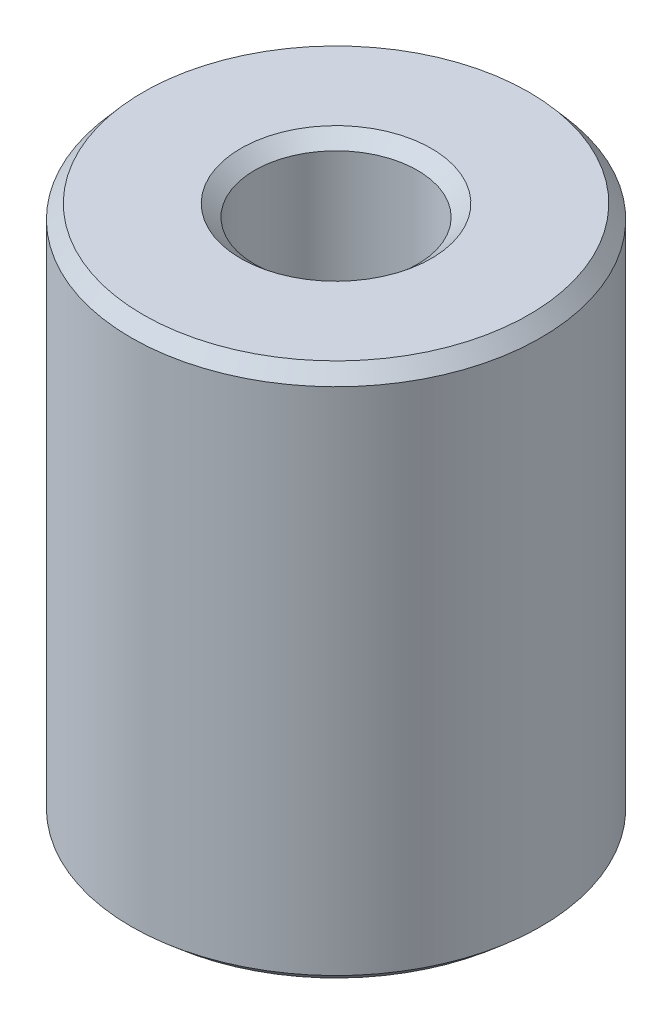
ISO-10303-21;
HEADER;
FILE_DESCRIPTION(('STEP AP214'),'2;1');
FILE_NAME('part.step','',(''),(''),'','','');
FILE_SCHEMA(('AUTOMOTIVE_DESIGN { 1 0 10303 214 1 1 1 1 }'));
ENDSEC;
DATA;
#1=APPLICATION_CONTEXT('core data for automotive mechanical design processes');
#2=APPLICATION_PROTOCOL_DEFINITION('international standard','automotive_design',2000,#1);
#3=PRODUCT_CONTEXT('',#1,'mechanical');
#4=PRODUCT('Part','Part','',(#3));
#5=PRODUCT_RELATED_PRODUCT_CATEGORY('part','',(#4));
#6=PRODUCT_DEFINITION_FORMATION('','',#4);
#7=PRODUCT_DEFINITION_CONTEXT('part definition',#1,'design');
#8=PRODUCT_DEFINITION('design','',#6,#7);
#9=PRODUCT_DEFINITION_SHAPE('','',#8);
#10=(LENGTH_UNIT() NAMED_UNIT(*) SI_UNIT(.MILLI.,.METRE.));
#11=(NAMED_UNIT(*) PLANE_ANGLE_UNIT() SI_UNIT($,.RADIAN.));
#12=(NAMED_UNIT(*) SI_UNIT($,.STERADIAN.) SOLID_ANGLE_UNIT());
#13=UNCERTAINTY_MEASURE_WITH_UNIT(LENGTH_MEASURE(1.E-05),#10,'distance_accuracy_value','');
#14=(GEOMETRIC_REPRESENTATION_CONTEXT(3) GLOBAL_UNCERTAINTY_ASSIGNED_CONTEXT((#13)) GLOBAL_UNIT_ASSIGNED_CONTEXT((#10,
#11,#12)) REPRESENTATION_CONTEXT('',''));
#15=CARTESIAN_POINT('',(0.,0.,0.));
#16=DIRECTION('',(0.,0.,1.));
#17=DIRECTION('',(1.,0.,0.));
#18=AXIS2_PLACEMENT_3D('',#15,#16,#17);
#19=CARTESIAN_POINT('',(0.,71.9350325143763,0.));
#20=DIRECTION('',(0.,-1.,0.));
#21=DIRECTION('',(0.,0.,-1.));
#22=AXIS2_PLACEMENT_3D('',#19,#20,#21);
#23=CYLINDRICAL_SURFACE('',#22,27.5);
#24=CARTESIAN_POINT('',(0.,1.60686689080611,0.));
#25=DIRECTION('',(0.,1.,0.));
#26=DIRECTION('',(0.,0.,1.));
#27=AXIS2_PLACEMENT_3D('',#24,#25,#26);
#28=CIRCLE('',#27,27.5);
#29=CARTESIAN_POINT('',(0.,1.60686689080611,27.5));
#30=VERTEX_POINT('',#29);
#31=EDGE_CURVE('E10',#30,#30,#28,.T.);
#32=ORIENTED_EDGE('',*,*,#31,.T.);
#33=EDGE_LOOP('',(#32));
#34=FACE_BOUND('',#33,.T.);
#35=CARTESIAN_POINT('',(0.,70.065515395934,0.));
#36=DIRECTION('',(0.,1.,0.));
#37=DIRECTION('',(0.,0.,1.));
#38=AXIS2_PLACEMENT_3D('',#35,#36,#37);
#39=CIRCLE('',#38,27.5);
#40=CARTESIAN_POINT('',(0.,70.065515395934,27.5));
#41=VERTEX_POINT('',#40);
#42=EDGE_CURVE('E50',#41,#41,#39,.F.);
#43=ORIENTED_EDGE('',*,*,#42,.T.);
#44=EDGE_LOOP('',(#43));
#45=FACE_BOUND('',#44,.T.);
#46=ADVANCED_FACE('F39',(#34,#45),#23,.T.);
#47=CARTESIAN_POINT('',(0.,71.9350325143763,0.));
#48=DIRECTION('',(0.,1.,0.));
#49=DIRECTION('',(0.,0.,1.));
#50=AXIS2_PLACEMENT_3D('',#47,#48,#49);
#51=PLANE('',#50);
#52=CARTESIAN_POINT('',(0.,71.9350325143763,0.));
#53=DIRECTION('',(0.,1.,0.));
#54=DIRECTION('',(0.,0.,1.));
#55=AXIS2_PLACEMENT_3D('',#52,#53,#54);
#56=CIRCLE('',#55,12.8004888223602);
#57=CARTESIAN_POINT('',(0.,71.9350325143763,12.8004888223602));
#58=VERTEX_POINT('',#57);
#59=EDGE_CURVE('E58',#58,#58,#56,.F.);
#60=ORIENTED_EDGE('',*,*,#59,.T.);
#61=EDGE_LOOP('',(#60));
#62=FACE_BOUND('',#61,.T.);
#63=CARTESIAN_POINT('',(0.,71.9350325143763,0.));
#64=DIRECTION('',(0.,1.,0.));
#65=DIRECTION('',(0.,0.,1.));
#66=AXIS2_PLACEMENT_3D('',#63,#64,#65);
#67=CIRCLE('',#66,25.8931331091938);
#68=CARTESIAN_POINT('',(0.,71.9350325143763,25.8931331091938));
#69=VERTEX_POINT('',#68);
#70=EDGE_CURVE('E61',#69,#69,#67,.T.);
#71=ORIENTED_EDGE('',*,*,#70,.T.);
#72=EDGE_LOOP('',(#71));
#73=FACE_BOUND('',#72,.T.);
#74=ADVANCED_FACE('F88',(#62,#73),#51,.T.);
#75=CARTESIAN_POINT('',(0.,0.,0.));
#76=DIRECTION('',(0.,1.,0.));
#77=DIRECTION('',(0.,0.,1.));
#78=AXIS2_PLACEMENT_3D('',#75,#76,#77);
#79=PLANE('',#78);
#80=CARTESIAN_POINT('',(0.,0.,0.));
#81=DIRECTION('',(0.,1.,0.));
#82=DIRECTION('',(0.,0.,1.));
#83=AXIS2_PLACEMENT_3D('',#80,#81,#82);
#84=CIRCLE('',#83,12.537838594724);
#85=CARTESIAN_POINT('',(0.,0.,12.537838594724));
#86=VERTEX_POINT('',#85);
#87=EDGE_CURVE('E51',#86,#86,#84,.T.);
#88=ORIENTED_EDGE('',*,*,#87,.T.);
#89=EDGE_LOOP('',(#88));
#90=FACE_BOUND('',#89,.T.);
#91=CARTESIAN_POINT('',(0.,0.,0.));
#92=DIRECTION('',(0.,1.,0.));
#93=DIRECTION('',(0.,0.,1.));
#94=AXIS2_PLACEMENT_3D('',#91,#92,#93);
#95=CIRCLE('',#94,25.6304828815577);
#96=CARTESIAN_POINT('',(0.,0.,25.6304828815577));
#97=VERTEX_POINT('',#96);
#98=EDGE_CURVE('E54',#97,#97,#95,.F.);
#99=ORIENTED_EDGE('',*,*,#98,.T.);
#100=EDGE_LOOP('',(#99));
#101=FACE_BOUND('',#100,.T.);
#102=ADVANCED_FACE('F83',(#90,#101),#79,.F.);
#103=CARTESIAN_POINT('',(0.,71.9350325143763,0.));
#104=DIRECTION('',(0.,-1.,0.));
#105=DIRECTION('',(0.,0.,-1.));
#106=AXIS2_PLACEMENT_3D('',#103,#104,#105);
#107=CYLINDRICAL_SURFACE('',#106,10.9309717039179);
#108=CARTESIAN_POINT('',(0.,70.3281656235702,0.));
#109=DIRECTION('',(0.,1.,0.));
#110=DIRECTION('',(0.,0.,1.));
#111=AXIS2_PLACEMENT_3D('',#108,#109,#110);
#112=CIRCLE('',#111,10.9309717039179);
#113=CARTESIAN_POINT('',(0.,70.3281656235702,10.9309717039179));
#114=VERTEX_POINT('',#113);
#115=EDGE_CURVE('E67',#114,#114,#112,.T.);
#116=ORIENTED_EDGE('',*,*,#115,.T.);
#117=EDGE_LOOP('',(#116));
#118=FACE_BOUND('',#117,.T.);
#119=CARTESIAN_POINT('',(0.,1.8695171184423,0.));
#120=DIRECTION('',(0.,1.,0.));
#121=DIRECTION('',(0.,0.,1.));
#122=AXIS2_PLACEMENT_3D('',#119,#120,#121);
#123=CIRCLE('',#122,10.9309717039179);
#124=CARTESIAN_POINT('',(0.,1.8695171184423,10.9309717039179));
#125=VERTEX_POINT('',#124);
#126=EDGE_CURVE('E69',#125,#125,#123,.F.);
#127=ORIENTED_EDGE('',*,*,#126,.T.);
#128=EDGE_LOOP('',(#127));
#129=FACE_BOUND('',#128,.T.);
#130=ADVANCED_FACE('F71',(#118,#129),#107,.F.);
#131=CARTESIAN_POINT('',(0.,70.3281656235702,0.));
#132=DIRECTION('',(0.,1.,0.));
#133=DIRECTION('',(0.,0.,1.));
#134=AXIS2_PLACEMENT_3D('',#131,#132,#133);
#135=CONICAL_SURFACE('',#134,10.9309717039179,0.860807605288894);
#136=CARTESIAN_POINT('',(0.,71.9350325143763,12.8004888223602));
#137=CARTESIAN_POINT('',(0.,71.9182943175971,12.7810146857097));
#138=CARTESIAN_POINT('',(0.,71.9015561208179,12.7615405490593));
#139=CARTESIAN_POINT('',(0.,71.8680797272594,12.7225922757584));
#140=CARTESIAN_POINT('',(0.,71.8513415304802,12.703118139108));
#141=CARTESIAN_POINT('',(0.,71.8178651369217,12.6641698658071));
#142=CARTESIAN_POINT('',(0.,71.8011269401425,12.6446957291566));
#143=CARTESIAN_POINT('',(0.,71.767650546584,12.6057474558558));
#144=CARTESIAN_POINT('',(0.,71.7509123498048,12.5862733192053));
#145=CARTESIAN_POINT('',(0.,71.7174359562463,12.5473250459044));
#146=CARTESIAN_POINT('',(0.,71.7006977594671,12.527850909254));
#147=CARTESIAN_POINT('',(0.,71.6672213659086,12.4889026359531));
#148=CARTESIAN_POINT('',(0.,71.6504831691294,12.4694284993027));
#149=CARTESIAN_POINT('',(0.,71.6170067755709,12.4304802260018));
#150=CARTESIAN_POINT('',(0.,71.6002685787917,12.4110060893514));
#151=CARTESIAN_POINT('',(0.,71.5667921852332,12.3720578160505));
#152=CARTESIAN_POINT('',(0.,71.550053988454,12.3525836794));
#153=CARTESIAN_POINT('',(0.,71.5165775948956,12.3136354060992));
#154=CARTESIAN_POINT('',(0.,71.4998393981163,12.2941612694487));
#155=CARTESIAN_POINT('',(0.,71.4663630045579,12.2552129961478));
#156=CARTESIAN_POINT('',(0.,71.4496248077786,12.2357388594974));
#157=CARTESIAN_POINT('',(0.,71.4161484142202,12.1967905861965));
#158=CARTESIAN_POINT('',(0.,71.3994102174409,12.1773164495461));
#159=CARTESIAN_POINT('',(0.,71.3659338238825,12.1383681762452));
#160=CARTESIAN_POINT('',(0.,71.3491956271032,12.1188940395948));
#161=CARTESIAN_POINT('',(0.,71.3157192335448,12.0799457662939));
#162=CARTESIAN_POINT('',(0.,71.2989810367655,12.0604716296434));
#163=CARTESIAN_POINT('',(0.,71.2655046432071,12.0215233563426));
#164=CARTESIAN_POINT('',(0.,71.2487664464279,12.0020492196921));
#165=CARTESIAN_POINT('',(0.,71.2152900528694,11.9631009463912));
#166=CARTESIAN_POINT('',(0.,71.1985518560902,11.9436268097408));
#167=CARTESIAN_POINT('',(0.,71.1650754625317,11.9046785364399));
#168=CARTESIAN_POINT('',(0.,71.1483372657525,11.8852043997895));
#169=CARTESIAN_POINT('',(0.,71.114860872194,11.8462561264886));
#170=CARTESIAN_POINT('',(0.,71.0981226754148,11.8267819898381));
#171=CARTESIAN_POINT('',(0.,71.0646462818563,11.7878337165373));
#172=CARTESIAN_POINT('',(0.,71.0479080850771,11.7683595798868));
#173=CARTESIAN_POINT('',(0.,71.0144316915186,11.7294113065859));
#174=CARTESIAN_POINT('',(0.,70.9976934947394,11.7099371699355));
#175=CARTESIAN_POINT('',(0.,70.9642171011809,11.6709888966346));
#176=CARTESIAN_POINT('',(0.,70.9474789044017,11.6515147599842));
#177=CARTESIAN_POINT('',(0.,70.9140025108432,11.6125664866833));
#178=CARTESIAN_POINT('',(0.,70.897264314064,11.5930923500329));
#179=CARTESIAN_POINT('',(0.,70.8637879205055,11.554144076732));
#180=CARTESIAN_POINT('',(0.,70.8470497237263,11.5346699400815));
#181=CARTESIAN_POINT('',(0.,70.8135733301679,11.4957216667807));
#182=CARTESIAN_POINT('',(0.,70.7968351333886,11.4762475301302));
#183=CARTESIAN_POINT('',(0.,70.7633587398302,11.4372992568293));
#184=CARTESIAN_POINT('',(0.,70.7466205430509,11.4178251201789));
#185=CARTESIAN_POINT('',(0.,70.7131441494925,11.378876846878));
#186=CARTESIAN_POINT('',(0.,70.6964059527132,11.3594027102276));
#187=CARTESIAN_POINT('',(0.,70.6629295591548,11.3204544369267));
#188=CARTESIAN_POINT('',(0.,70.6461913623755,11.3009803002763));
#189=CARTESIAN_POINT('',(0.,70.6127149688171,11.2620320269754));
#190=CARTESIAN_POINT('',(0.,70.5959767720379,11.2425578903249));
#191=CARTESIAN_POINT('',(0.,70.5625003784794,11.203609617024));
#192=CARTESIAN_POINT('',(0.,70.5457621817002,11.1841354803736));
#193=CARTESIAN_POINT('',(0.,70.5122857881417,11.1451872070727));
#194=CARTESIAN_POINT('',(0.,70.4955475913625,11.1257130704223));
#195=CARTESIAN_POINT('',(0.,70.462071197804,11.0867647971214));
#196=CARTESIAN_POINT('',(0.,70.4453330010248,11.067290660471));
#197=CARTESIAN_POINT('',(0.,70.4118566074663,11.0283423871701));
#198=CARTESIAN_POINT('',(0.,70.3951184106871,11.0088682505196));
#199=CARTESIAN_POINT('',(0.,70.3616420171286,10.9699199772188));
#200=CARTESIAN_POINT('',(0.,70.3449038203494,10.9504458405683));
#201=CARTESIAN_POINT('',(0.,70.3281656235702,10.9309717039179));
#202=B_SPLINE_CURVE_WITH_KNOTS('',3,(#136,#137,#138,#139,#140,#141,#142,#143,#144,#145,#146,
#147,#148,#149,#150,#151,#152,#153,#154,#155,#156,#157,#158,#159,#160,#161,#162,#163,#164,#165,
#166,#167,#168,#169,#170,#171,#172,#173,#174,#175,#176,#177,#178,#179,#180,#181,#182,#183,#184,
#185,#186,#187,#188,#189,#190,#191,#192,#193,#194,#195,#196,#197,#198,#199,#200,#201),
.UNSPECIFIED.,.F.,.F.,(4,2,2,2,2,2,2,2,2,2,2,2,2,2,2,2,2,2,2,2,2,2,2,2,2,2,2,2,2,2,2,2,4),(0.,
0.0770368941955876,0.154073788391174,0.231110682586762,0.308147576782358,0.385184470977946,
0.462221365173534,0.53925825936913,0.616295153564718,0.693332047760306,0.770368941955902,
0.847405836151488,0.924442730347076,1.00147962454267,1.07851651873826,1.15555341293385,
1.23259030712944,1.30962720132503,1.38666409552062,1.46370098971621,1.5407378839118,
1.61777477810739,1.69481167230298,1.77184856649857,1.84888546069416,1.92592235488975,
2.00295924908535,2.07999614328093,2.15703303747652,2.23406993167212,2.31110682586771,
2.38814372006329,2.46518061425888),.UNSPECIFIED.);
#203=EDGE_CURVE('BSEAM77',#58,#114,#202,.T.);
#204=ORIENTED_EDGE('',*,*,#59,.F.);
#205=ORIENTED_EDGE('',*,*,#115,.F.);
#206=ORIENTED_EDGE('',*,*,#203,.T.);
#207=ORIENTED_EDGE('',*,*,#203,.F.);
#208=EDGE_LOOP('',(#204,#206,#205,#207));
#209=FACE_BOUND('',#208,.T.);
#210=ADVANCED_FACE('F77',(#209),#135,.F.);
#211=CARTESIAN_POINT('',(0.,0.,0.));
#212=DIRECTION('',(0.,-1.,0.));
#213=DIRECTION('',(0.,0.,-1.));
#214=AXIS2_PLACEMENT_3D('',#211,#212,#213);
#215=CONICAL_SURFACE('',#214,12.537838594724,0.709988721505996);
#216=ORIENTED_EDGE('',*,*,#126,.F.);
#217=EDGE_LOOP('',(#216));
#218=FACE_BOUND('',#217,.T.);
#219=ORIENTED_EDGE('',*,*,#87,.F.);
#220=EDGE_LOOP('',(#219));
#221=FACE_BOUND('',#220,.T.);
#222=ADVANCED_FACE('F73',(#218,#221),#215,.F.);
#223=CARTESIAN_POINT('',(0.,1.60686689080611,0.));
#224=DIRECTION('',(0.,1.,0.));
#225=DIRECTION('',(0.,0.,1.));
#226=AXIS2_PLACEMENT_3D('',#223,#224,#225);
#227=CONICAL_SURFACE('',#226,27.5,0.860807605288901);
#228=CARTESIAN_POINT('',(0.,0.,25.6304828815577));
#229=CARTESIAN_POINT('',(0.,0.0167381967792305,25.6499570182082));
#230=CARTESIAN_POINT('',(0.,0.0334763935584607,25.6694311548586));
#231=CARTESIAN_POINT('',(0.,0.0669527871169212,25.7083794281595));
#232=CARTESIAN_POINT('',(0.,0.0836909838961514,25.7278535648099));
#233=CARTESIAN_POINT('',(0.,0.117167377454612,25.7668018381108));
#234=CARTESIAN_POINT('',(0.,0.133905574233842,25.7862759747613));
#235=CARTESIAN_POINT('',(0.,0.167381967792303,25.8252242480621));
#236=CARTESIAN_POINT('',(0.,0.184120164571533,25.8446983847126));
#237=CARTESIAN_POINT('',(0.,0.217596558129994,25.8836466580135));
#238=CARTESIAN_POINT('',(0.,0.234334754909224,25.9031207946639));
#239=CARTESIAN_POINT('',(0.,0.267811148467684,25.9420690679648));
#240=CARTESIAN_POINT('',(0.,0.284549345246915,25.9615432046152));
#241=CARTESIAN_POINT('',(0.,0.318025738805376,26.0004914779161));
#242=CARTESIAN_POINT('',(0.,0.334763935584606,26.0199656145665));
#243=CARTESIAN_POINT('',(0.,0.368240329143066,26.0589138878674));
#244=CARTESIAN_POINT('',(0.,0.384978525922296,26.0783880245179));
#245=CARTESIAN_POINT('',(0.,0.418454919480757,26.1173362978187));
#246=CARTESIAN_POINT('',(0.,0.435193116259988,26.1368104344692));
#247=CARTESIAN_POINT('',(0.,0.468669509818448,26.1757587077701));
#248=CARTESIAN_POINT('',(0.,0.485407706597678,26.1952328444205));
#249=CARTESIAN_POINT('',(0.,0.518884100156138,26.2341811177214));
#250=CARTESIAN_POINT('',(0.,0.535622296935369,26.2536552543718));
#251=CARTESIAN_POINT('',(0.,0.56909869049383,26.2926035276727));
#252=CARTESIAN_POINT('',(0.,0.58583688727306,26.3120776643232));
#253=CARTESIAN_POINT('',(0.,0.61931328083152,26.351025937624));
#254=CARTESIAN_POINT('',(0.,0.63605147761075,26.3705000742745));
#255=CARTESIAN_POINT('',(0.,0.669527871169211,26.4094483475754));
#256=CARTESIAN_POINT('',(0.,0.686266067948442,26.4289224842258));
#257=CARTESIAN_POINT('',(0.,0.719742461506903,26.4678707575267));
#258=CARTESIAN_POINT('',(0.,0.736480658286132,26.4873448941771));
#259=CARTESIAN_POINT('',(0.,0.769957051844593,26.526293167478));
#260=CARTESIAN_POINT('',(0.,0.786695248623824,26.5457673041284));
#261=CARTESIAN_POINT('',(0.,0.820171642182284,26.5847155774293));
#262=CARTESIAN_POINT('',(0.,0.836909838961515,26.6041897140798));
#263=CARTESIAN_POINT('',(0.,0.870386232519975,26.6431379873806));
#264=CARTESIAN_POINT('',(0.,0.887124429299205,26.6626121240311));
#265=CARTESIAN_POINT('',(0.,0.920600822857666,26.701560397332));
#266=CARTESIAN_POINT('',(0.,0.937339019636896,26.7210345339824));
#267=CARTESIAN_POINT('',(0.,0.970815413195357,26.7599828072833));
#268=CARTESIAN_POINT('',(0.,0.987553609974587,26.7794569439337));
#269=CARTESIAN_POINT('',(0.,1.02103000353305,26.8184052172346));
#270=CARTESIAN_POINT('',(0.,1.03776820031228,26.837879353885));
#271=CARTESIAN_POINT('',(0.,1.07124459387074,26.8768276271859));
#272=CARTESIAN_POINT('',(0.,1.08798279064997,26.8963017638364));
#273=CARTESIAN_POINT('',(0.,1.12145918420843,26.9352500371372));
#274=CARTESIAN_POINT('',(0.,1.13819738098766,26.9547241737877));
#275=CARTESIAN_POINT('',(0.,1.17167377454612,26.9936724470886));
#276=CARTESIAN_POINT('',(0.,1.18841197132535,27.013146583739));
#277=CARTESIAN_POINT('',(0.,1.22188836488381,27.0520948570399));
#278=CARTESIAN_POINT('',(0.,1.23862656166304,27.0715689936903));
#279=CARTESIAN_POINT('',(0.,1.2721029552215,27.1105172669912));
#280=CARTESIAN_POINT('',(0.,1.28884115200073,27.1299914036416));
#281=CARTESIAN_POINT('',(0.,1.32231754555919,27.1689396769425));
#282=CARTESIAN_POINT('',(0.,1.33905574233842,27.188413813593));
#283=CARTESIAN_POINT('',(0.,1.37253213589688,27.2273620868938));
#284=CARTESIAN_POINT('',(0.,1.38927033267611,27.2468362235443));
#285=CARTESIAN_POINT('',(0.,1.42274672623457,27.2857844968452));
#286=CARTESIAN_POINT('',(0.,1.43948492301381,27.3052586334956));
#287=CARTESIAN_POINT('',(0.,1.47296131657227,27.3442069067965));
#288=CARTESIAN_POINT('',(0.,1.4896995133515,27.3636810434469));
#289=CARTESIAN_POINT('',(0.,1.52317590690996,27.4026293167478));
#290=CARTESIAN_POINT('',(0.,1.53991410368919,27.4221034533982));
#291=CARTESIAN_POINT('',(0.,1.57339049724765,27.4610517266991));
#292=CARTESIAN_POINT('',(0.,1.59012869402688,27.4805258633496));
#293=CARTESIAN_POINT('',(0.,1.60686689080611,27.5));
#294=B_SPLINE_CURVE_WITH_KNOTS('',3,(#228,#229,#230,#231,#232,#233,#234,#235,#236,#237,#238,
#239,#240,#241,#242,#243,#244,#245,#246,#247,#248,#249,#250,#251,#252,#253,#254,#255,#256,#257,
#258,#259,#260,#261,#262,#263,#264,#265,#266,#267,#268,#269,#270,#271,#272,#273,#274,#275,#276,
#277,#278,#279,#280,#281,#282,#283,#284,#285,#286,#287,#288,#289,#290,#291,#292,#293),
.UNSPECIFIED.,.F.,.F.,(4,2,2,2,2,2,2,2,2,2,2,2,2,2,2,2,2,2,2,2,2,2,2,2,2,2,2,2,2,2,2,2,4),(0.,
0.0770368941955867,0.154073788391176,0.231110682586765,0.308147576782352,0.385184470977941,
0.462221365173528,0.539258259369117,0.616295153564707,0.693332047760294,0.770368941955883,
0.84740583615147,0.924442730347059,1.00147962454265,1.07851651873823,1.15555341293382,
1.23259030712941,1.309627201325,1.38666409552059,1.46370098971618,1.54073788391177,
1.61777477810735,1.69481167230294,1.77184856649853,1.84888546069412,1.92592235488971,
2.00295924908529,2.07999614328088,2.15703303747647,2.23406993167206,2.31110682586765,
2.38814372006324,2.46518061425883),.UNSPECIFIED.);
#295=EDGE_CURVE('BSEAM76',#97,#30,#294,.T.);
#296=ORIENTED_EDGE('',*,*,#98,.F.);
#297=ORIENTED_EDGE('',*,*,#31,.F.);
#298=ORIENTED_EDGE('',*,*,#295,.T.);
#299=ORIENTED_EDGE('',*,*,#295,.F.);
#300=EDGE_LOOP('',(#296,#298,#297,#299));
#301=FACE_BOUND('',#300,.T.);
#302=ADVANCED_FACE('F76',(#301),#227,.T.);
#303=CARTESIAN_POINT('',(0.,71.9350325143763,0.));
#304=DIRECTION('',(0.,-1.,0.));
#305=DIRECTION('',(0.,0.,-1.));
#306=AXIS2_PLACEMENT_3D('',#303,#304,#305);
#307=CONICAL_SURFACE('',#306,25.8931331091938,0.709988721505998);
#308=ORIENTED_EDGE('',*,*,#42,.F.);
#309=EDGE_LOOP('',(#308));
#310=FACE_BOUND('',#309,.T.);
#311=ORIENTED_EDGE('',*,*,#70,.F.);
#312=EDGE_LOOP('',(#311));
#313=FACE_BOUND('',#312,.T.);
#314=ADVANCED_FACE('F45',(#310,#313),#307,.T.);
#315=CLOSED_SHELL('',(#46,#74,#102,#130,#210,#222,#302,#314));
#316=MANIFOLD_SOLID_BREP('B2',#315);
#317=ADVANCED_BREP_SHAPE_REPRESENTATION('',(#18,#316),#14);
#318=SHAPE_DEFINITION_REPRESENTATION(#9,#317);
ENDSEC;
END-ISO-10303-21;
